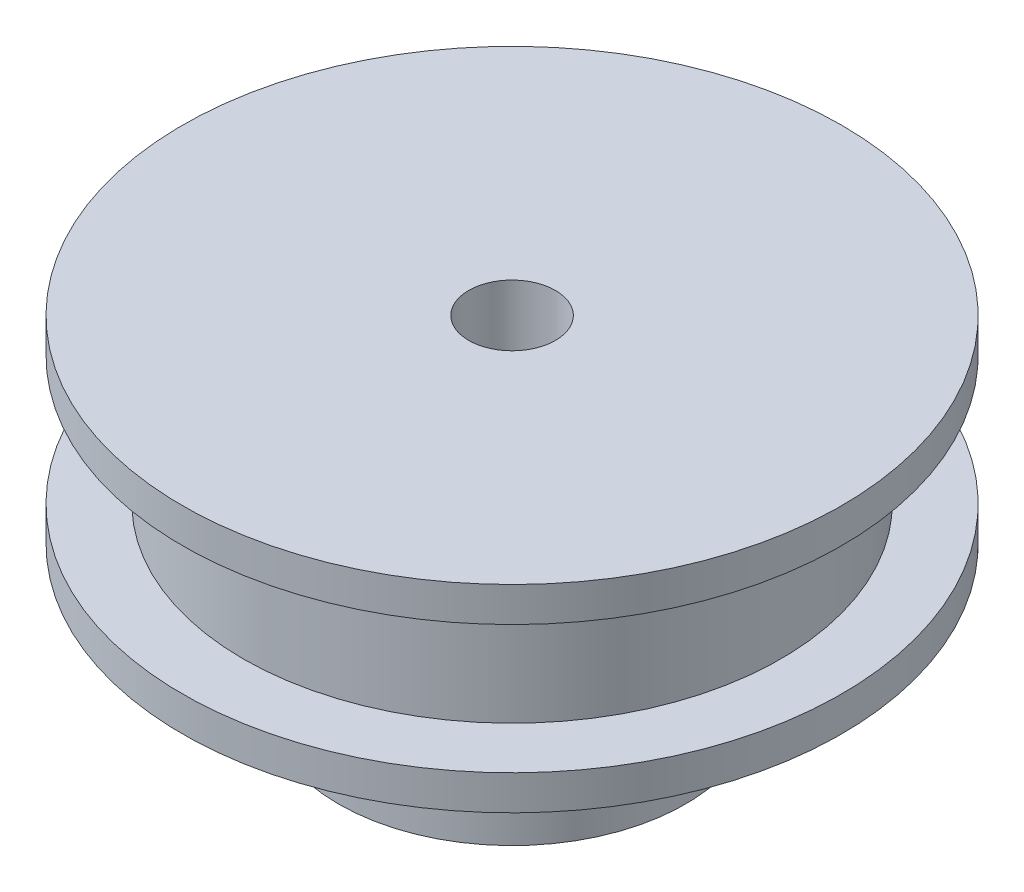
ISO-10303-21;
HEADER;
FILE_DESCRIPTION(('STEP AP214'),'2;1');
FILE_NAME('part.step','',(''),(''),'','','');
FILE_SCHEMA(('AUTOMOTIVE_DESIGN { 1 0 10303 214 1 1 1 1 }'));
ENDSEC;
DATA;
#1=APPLICATION_CONTEXT('core data for automotive mechanical design processes');
#2=APPLICATION_PROTOCOL_DEFINITION('international standard','automotive_design',2000,#1);
#3=PRODUCT_CONTEXT('',#1,'mechanical');
#4=PRODUCT('Part','Part','',(#3));
#5=PRODUCT_RELATED_PRODUCT_CATEGORY('part','',(#4));
#6=PRODUCT_DEFINITION_FORMATION('','',#4);
#7=PRODUCT_DEFINITION_CONTEXT('part definition',#1,'design');
#8=PRODUCT_DEFINITION('design','',#6,#7);
#9=PRODUCT_DEFINITION_SHAPE('','',#8);
#10=(LENGTH_UNIT() NAMED_UNIT(*) SI_UNIT(.MILLI.,.METRE.));
#11=(NAMED_UNIT(*) PLANE_ANGLE_UNIT() SI_UNIT($,.RADIAN.));
#12=(NAMED_UNIT(*) SI_UNIT($,.STERADIAN.) SOLID_ANGLE_UNIT());
#13=UNCERTAINTY_MEASURE_WITH_UNIT(LENGTH_MEASURE(1.E-05),#10,'distance_accuracy_value','');
#14=(GEOMETRIC_REPRESENTATION_CONTEXT(3) GLOBAL_UNCERTAINTY_ASSIGNED_CONTEXT((#13)) GLOBAL_UNIT_ASSIGNED_CONTEXT((#10,
#11,#12)) REPRESENTATION_CONTEXT('',''));
#15=CARTESIAN_POINT('',(0.,0.,0.));
#16=DIRECTION('',(0.,0.,1.));
#17=DIRECTION('',(1.,0.,0.));
#18=AXIS2_PLACEMENT_3D('',#15,#16,#17);
#19=CARTESIAN_POINT('',(-15.5,10.,0.));
#20=DIRECTION('',(0.,-1.,0.));
#21=DIRECTION('',(0.,0.,-1.));
#22=AXIS2_PLACEMENT_3D('',#19,#20,#21);
#23=PLANE('',#22);
#24=CARTESIAN_POINT('',(0.,10.,0.));
#25=DIRECTION('',(0.,-1.,0.));
#26=DIRECTION('',(0.,0.,-1.));
#27=AXIS2_PLACEMENT_3D('',#24,#25,#26);
#28=CIRCLE('',#27,19.);
#29=CARTESIAN_POINT('',(0.,10.,-19.));
#30=VERTEX_POINT('',#29);
#31=EDGE_CURVE('E10',#30,#30,#28,.T.);
#32=ORIENTED_EDGE('',*,*,#31,.F.);
#33=EDGE_LOOP('',(#32));
#34=FACE_BOUND('',#33,.T.);
#35=CARTESIAN_POINT('',(0.,10.,0.));
#36=DIRECTION('',(0.,-1.,0.));
#37=DIRECTION('',(0.,0.,-1.));
#38=AXIS2_PLACEMENT_3D('',#35,#36,#37);
#39=CIRCLE('',#38,15.5);
#40=CARTESIAN_POINT('',(0.,10.,-15.5));
#41=VERTEX_POINT('',#40);
#42=EDGE_CURVE('E69',#41,#41,#39,.T.);
#43=ORIENTED_EDGE('',*,*,#42,.T.);
#44=EDGE_LOOP('',(#43));
#45=FACE_BOUND('',#44,.T.);
#46=ADVANCED_FACE('F35',(#34,#45),#23,.F.);
#47=CARTESIAN_POINT('',(0.,0.,0.));
#48=DIRECTION('',(0.,-1.,0.));
#49=DIRECTION('',(0.,0.,-1.));
#50=AXIS2_PLACEMENT_3D('',#47,#48,#49);
#51=CYLINDRICAL_SURFACE('',#50,19.);
#52=CARTESIAN_POINT('',(0.,8.,0.));
#53=DIRECTION('',(0.,-1.,0.));
#54=DIRECTION('',(0.,0.,-1.));
#55=AXIS2_PLACEMENT_3D('',#52,#53,#54);
#56=CIRCLE('',#55,19.);
#57=CARTESIAN_POINT('',(0.,8.,-19.));
#58=VERTEX_POINT('',#57);
#59=EDGE_CURVE('E41',#58,#58,#56,.T.);
#60=ORIENTED_EDGE('',*,*,#59,.F.);
#61=EDGE_LOOP('',(#60));
#62=FACE_BOUND('',#61,.T.);
#63=ORIENTED_EDGE('',*,*,#31,.T.);
#64=EDGE_LOOP('',(#63));
#65=FACE_BOUND('',#64,.T.);
#66=ADVANCED_FACE('F118',(#62,#65),#51,.T.);
#67=CARTESIAN_POINT('',(-19.,8.,0.));
#68=DIRECTION('',(0.,1.,0.));
#69=DIRECTION('',(0.,0.,1.));
#70=AXIS2_PLACEMENT_3D('',#67,#68,#69);
#71=PLANE('',#70);
#72=CARTESIAN_POINT('',(0.,8.,0.));
#73=DIRECTION('',(0.,-1.,0.));
#74=DIRECTION('',(0.,0.,-1.));
#75=AXIS2_PLACEMENT_3D('',#72,#73,#74);
#76=CIRCLE('',#75,10.);
#77=CARTESIAN_POINT('',(0.,8.,-10.));
#78=VERTEX_POINT('',#77);
#79=EDGE_CURVE('E45',#78,#78,#76,.T.);
#80=ORIENTED_EDGE('',*,*,#79,.F.);
#81=EDGE_LOOP('',(#80));
#82=FACE_BOUND('',#81,.T.);
#83=ORIENTED_EDGE('',*,*,#59,.T.);
#84=EDGE_LOOP('',(#83));
#85=FACE_BOUND('',#84,.T.);
#86=ADVANCED_FACE('F113',(#82,#85),#71,.F.);
#87=CARTESIAN_POINT('',(0.,0.,0.));
#88=DIRECTION('',(0.,-1.,0.));
#89=DIRECTION('',(0.,0.,-1.));
#90=AXIS2_PLACEMENT_3D('',#87,#88,#89);
#91=CYLINDRICAL_SURFACE('',#90,10.);
#92=CARTESIAN_POINT('',(0.,0.,0.));
#93=DIRECTION('',(0.,-1.,0.));
#94=DIRECTION('',(0.,0.,-1.));
#95=AXIS2_PLACEMENT_3D('',#92,#93,#94);
#96=CIRCLE('',#95,10.);
#97=CARTESIAN_POINT('',(0.,0.,-10.));
#98=VERTEX_POINT('',#97);
#99=EDGE_CURVE('E49',#98,#98,#96,.T.);
#100=ORIENTED_EDGE('',*,*,#99,.F.);
#101=EDGE_LOOP('',(#100));
#102=FACE_BOUND('',#101,.T.);
#103=ORIENTED_EDGE('',*,*,#79,.T.);
#104=EDGE_LOOP('',(#103));
#105=FACE_BOUND('',#104,.T.);
#106=ADVANCED_FACE('F107',(#102,#105),#91,.T.);
#107=CARTESIAN_POINT('',(-10.,0.,0.));
#108=DIRECTION('',(0.,1.,0.));
#109=DIRECTION('',(0.,0.,1.));
#110=AXIS2_PLACEMENT_3D('',#107,#108,#109);
#111=PLANE('',#110);
#112=CARTESIAN_POINT('',(0.,0.,0.));
#113=DIRECTION('',(0.,-1.,0.));
#114=DIRECTION('',(0.,0.,-1.));
#115=AXIS2_PLACEMENT_3D('',#112,#113,#114);
#116=CIRCLE('',#115,2.5);
#117=CARTESIAN_POINT('',(0.,0.,-2.5));
#118=VERTEX_POINT('',#117);
#119=EDGE_CURVE('E54',#118,#118,#116,.T.);
#120=ORIENTED_EDGE('',*,*,#119,.F.);
#121=EDGE_LOOP('',(#120));
#122=FACE_BOUND('',#121,.T.);
#123=ORIENTED_EDGE('',*,*,#99,.T.);
#124=EDGE_LOOP('',(#123));
#125=FACE_BOUND('',#124,.T.);
#126=ADVANCED_FACE('F101',(#122,#125),#111,.F.);
#127=CARTESIAN_POINT('',(0.,0.,0.));
#128=DIRECTION('',(0.,-1.,0.));
#129=DIRECTION('',(0.,0.,-1.));
#130=AXIS2_PLACEMENT_3D('',#127,#128,#129);
#131=CYLINDRICAL_SURFACE('',#130,2.5);
#132=CARTESIAN_POINT('',(0.,19.4,0.));
#133=DIRECTION('',(0.,-1.,0.));
#134=DIRECTION('',(0.,0.,-1.));
#135=AXIS2_PLACEMENT_3D('',#132,#133,#134);
#136=CIRCLE('',#135,2.5);
#137=CARTESIAN_POINT('',(0.,19.4,-2.5));
#138=VERTEX_POINT('',#137);
#139=EDGE_CURVE('E57',#138,#138,#136,.T.);
#140=ORIENTED_EDGE('',*,*,#139,.F.);
#141=EDGE_LOOP('',(#140));
#142=FACE_BOUND('',#141,.T.);
#143=ORIENTED_EDGE('',*,*,#119,.T.);
#144=EDGE_LOOP('',(#143));
#145=FACE_BOUND('',#144,.T.);
#146=ADVANCED_FACE('F95',(#142,#145),#131,.F.);
#147=CARTESIAN_POINT('',(-2.5,19.4,0.));
#148=DIRECTION('',(0.,-1.,0.));
#149=DIRECTION('',(0.,0.,-1.));
#150=AXIS2_PLACEMENT_3D('',#147,#148,#149);
#151=PLANE('',#150);
#152=CARTESIAN_POINT('',(0.,19.4,0.));
#153=DIRECTION('',(0.,-1.,0.));
#154=DIRECTION('',(0.,0.,-1.));
#155=AXIS2_PLACEMENT_3D('',#152,#153,#154);
#156=CIRCLE('',#155,19.);
#157=CARTESIAN_POINT('',(0.,19.4,-19.));
#158=VERTEX_POINT('',#157);
#159=EDGE_CURVE('E60',#158,#158,#156,.T.);
#160=ORIENTED_EDGE('',*,*,#159,.F.);
#161=EDGE_LOOP('',(#160));
#162=FACE_BOUND('',#161,.T.);
#163=ORIENTED_EDGE('',*,*,#139,.T.);
#164=EDGE_LOOP('',(#163));
#165=FACE_BOUND('',#164,.T.);
#166=ADVANCED_FACE('F89',(#162,#165),#151,.F.);
#167=CARTESIAN_POINT('',(0.,0.,0.));
#168=DIRECTION('',(0.,-1.,0.));
#169=DIRECTION('',(0.,0.,-1.));
#170=AXIS2_PLACEMENT_3D('',#167,#168,#169);
#171=CYLINDRICAL_SURFACE('',#170,19.);
#172=CARTESIAN_POINT('',(0.,17.4,0.));
#173=DIRECTION('',(0.,-1.,0.));
#174=DIRECTION('',(0.,0.,-1.));
#175=AXIS2_PLACEMENT_3D('',#172,#173,#174);
#176=CIRCLE('',#175,19.);
#177=CARTESIAN_POINT('',(0.,17.4,-19.));
#178=VERTEX_POINT('',#177);
#179=EDGE_CURVE('E63',#178,#178,#176,.T.);
#180=ORIENTED_EDGE('',*,*,#179,.F.);
#181=EDGE_LOOP('',(#180));
#182=FACE_BOUND('',#181,.T.);
#183=ORIENTED_EDGE('',*,*,#159,.T.);
#184=EDGE_LOOP('',(#183));
#185=FACE_BOUND('',#184,.T.);
#186=ADVANCED_FACE('F83',(#182,#185),#171,.T.);
#187=CARTESIAN_POINT('',(-19.,17.4,0.));
#188=DIRECTION('',(0.,1.,0.));
#189=DIRECTION('',(0.,0.,1.));
#190=AXIS2_PLACEMENT_3D('',#187,#188,#189);
#191=PLANE('',#190);
#192=CARTESIAN_POINT('',(0.,17.4,0.));
#193=DIRECTION('',(0.,-1.,0.));
#194=DIRECTION('',(0.,0.,-1.));
#195=AXIS2_PLACEMENT_3D('',#192,#193,#194);
#196=CIRCLE('',#195,15.5);
#197=CARTESIAN_POINT('',(0.,17.4,-15.5));
#198=VERTEX_POINT('',#197);
#199=EDGE_CURVE('E66',#198,#198,#196,.T.);
#200=ORIENTED_EDGE('',*,*,#199,.F.);
#201=EDGE_LOOP('',(#200));
#202=FACE_BOUND('',#201,.T.);
#203=ORIENTED_EDGE('',*,*,#179,.T.);
#204=EDGE_LOOP('',(#203));
#205=FACE_BOUND('',#204,.T.);
#206=ADVANCED_FACE('F77',(#202,#205),#191,.F.);
#207=CARTESIAN_POINT('',(0.,0.,0.));
#208=DIRECTION('',(0.,-1.,0.));
#209=DIRECTION('',(0.,0.,-1.));
#210=AXIS2_PLACEMENT_3D('',#207,#208,#209);
#211=CYLINDRICAL_SURFACE('',#210,15.5);
#212=ORIENTED_EDGE('',*,*,#42,.F.);
#213=EDGE_LOOP('',(#212));
#214=FACE_BOUND('',#213,.T.);
#215=ORIENTED_EDGE('',*,*,#199,.T.);
#216=EDGE_LOOP('',(#215));
#217=FACE_BOUND('',#216,.T.);
#218=ADVANCED_FACE('F74',(#214,#217),#211,.T.);
#219=CLOSED_SHELL('',(#46,#66,#86,#106,#126,#146,#166,#186,#206,#218));
#220=MANIFOLD_SOLID_BREP('B2',#219);
#221=ADVANCED_BREP_SHAPE_REPRESENTATION('',(#18,#220),#14);
#222=SHAPE_DEFINITION_REPRESENTATION(#9,#221);
ENDSEC;
END-ISO-10303-21;
